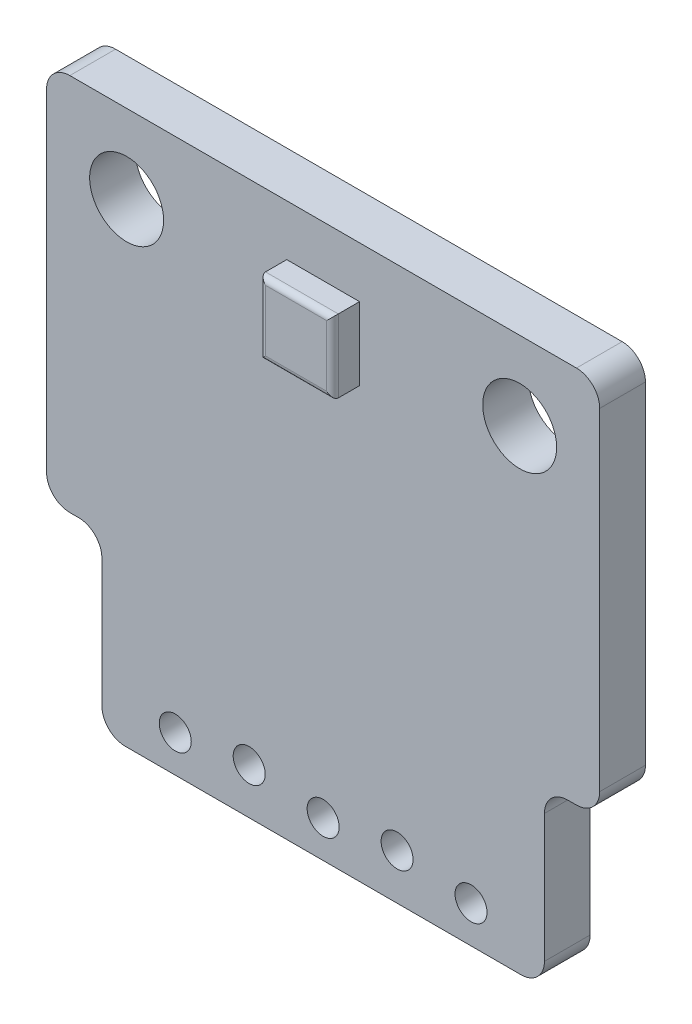
ISO-10303-21;
HEADER;
FILE_DESCRIPTION(('STEP AP214'),'2;1');
FILE_NAME('part.step','',(''),(''),'','','');
FILE_SCHEMA(('AUTOMOTIVE_DESIGN { 1 0 10303 214 1 1 1 1 }'));
ENDSEC;
DATA;
#1=APPLICATION_CONTEXT('core data for automotive mechanical design processes');
#2=APPLICATION_PROTOCOL_DEFINITION('international standard','automotive_design',2000,#1);
#3=PRODUCT_CONTEXT('',#1,'mechanical');
#4=PRODUCT('Part','Part','',(#3));
#5=PRODUCT_RELATED_PRODUCT_CATEGORY('part','',(#4));
#6=PRODUCT_DEFINITION_FORMATION('','',#4);
#7=PRODUCT_DEFINITION_CONTEXT('part definition',#1,'design');
#8=PRODUCT_DEFINITION('design','',#6,#7);
#9=PRODUCT_DEFINITION_SHAPE('','',#8);
#10=(LENGTH_UNIT() NAMED_UNIT(*) SI_UNIT(.MILLI.,.METRE.));
#11=(NAMED_UNIT(*) PLANE_ANGLE_UNIT() SI_UNIT($,.RADIAN.));
#12=(NAMED_UNIT(*) SI_UNIT($,.STERADIAN.) SOLID_ANGLE_UNIT());
#13=UNCERTAINTY_MEASURE_WITH_UNIT(LENGTH_MEASURE(1.E-05),#10,'distance_accuracy_value','');
#14=(GEOMETRIC_REPRESENTATION_CONTEXT(3) GLOBAL_UNCERTAINTY_ASSIGNED_CONTEXT((#13)) GLOBAL_UNIT_ASSIGNED_CONTEXT((#10,
#11,#12)) REPRESENTATION_CONTEXT('',''));
#15=CARTESIAN_POINT('',(0.,0.,0.));
#16=DIRECTION('',(0.,0.,1.));
#17=DIRECTION('',(1.,0.,0.));
#18=AXIS2_PLACEMENT_3D('',#15,#16,#17);
#19=CARTESIAN_POINT('',(0.,0.,1.57));
#20=DIRECTION('',(0.,0.,-1.));
#21=DIRECTION('',(-1.,0.,0.));
#22=AXIS2_PLACEMENT_3D('',#19,#20,#21);
#23=PLANE('',#22);
#24=CARTESIAN_POINT('',(5.08,1.27,1.57));
#25=DIRECTION('',(0.,0.,1.));
#26=DIRECTION('',(1.,0.,0.));
#27=AXIS2_PLACEMENT_3D('',#24,#25,#26);
#28=CIRCLE('',#27,0.55);
#29=CARTESIAN_POINT('',(5.63,1.27,1.57));
#30=VERTEX_POINT('',#29);
#31=EDGE_CURVE('E217',#30,#30,#28,.T.);
#32=ORIENTED_EDGE('',*,*,#31,.F.);
#33=EDGE_LOOP('',(#32));
#34=FACE_BOUND('',#33,.T.);
#35=CARTESIAN_POINT('',(-2.54,1.57,1.57));
#36=DIRECTION('',(0.,0.,1.));
#37=DIRECTION('',(1.,0.,0.));
#38=AXIS2_PLACEMENT_3D('',#35,#36,#37);
#39=CIRCLE('',#38,0.55);
#40=CARTESIAN_POINT('',(-1.99,1.57,1.57));
#41=VERTEX_POINT('',#40);
#42=EDGE_CURVE('E223',#41,#41,#39,.T.);
#43=ORIENTED_EDGE('',*,*,#42,.F.);
#44=EDGE_LOOP('',(#43));
#45=FACE_BOUND('',#44,.T.);
#46=CARTESIAN_POINT('',(-5.08,1.27,1.57));
#47=DIRECTION('',(0.,0.,1.));
#48=DIRECTION('',(1.,0.,0.));
#49=AXIS2_PLACEMENT_3D('',#46,#47,#48);
#50=CIRCLE('',#49,0.55);
#51=CARTESIAN_POINT('',(-4.53,1.27,1.57));
#52=VERTEX_POINT('',#51);
#53=EDGE_CURVE('E229',#52,#52,#50,.T.);
#54=ORIENTED_EDGE('',*,*,#53,.F.);
#55=EDGE_LOOP('',(#54));
#56=FACE_BOUND('',#55,.T.);
#57=CARTESIAN_POINT('',(0.,1.27,1.57));
#58=DIRECTION('',(0.,0.,1.));
#59=DIRECTION('',(1.,0.,0.));
#60=AXIS2_PLACEMENT_3D('',#57,#58,#59);
#61=CIRCLE('',#60,0.55);
#62=CARTESIAN_POINT('',(0.550000000000001,1.27,1.57));
#63=VERTEX_POINT('',#62);
#64=EDGE_CURVE('E235',#63,#63,#61,.T.);
#65=ORIENTED_EDGE('',*,*,#64,.F.);
#66=EDGE_LOOP('',(#65));
#67=FACE_BOUND('',#66,.T.);
#68=CARTESIAN_POINT('',(2.54,1.57,1.57));
#69=DIRECTION('',(0.,0.,1.));
#70=DIRECTION('',(1.,0.,0.));
#71=AXIS2_PLACEMENT_3D('',#68,#69,#70);
#72=CIRCLE('',#71,0.55);
#73=CARTESIAN_POINT('',(3.09,1.57,1.57));
#74=VERTEX_POINT('',#73);
#75=EDGE_CURVE('E241',#74,#74,#72,.T.);
#76=ORIENTED_EDGE('',*,*,#75,.F.);
#77=EDGE_LOOP('',(#76));
#78=FACE_BOUND('',#77,.T.);
#79=CARTESIAN_POINT('',(6.75,16.3,1.57));
#80=DIRECTION('',(0.,0.,1.));
#81=DIRECTION('',(1.,0.,0.));
#82=AXIS2_PLACEMENT_3D('',#79,#80,#81);
#83=CIRCLE('',#82,1.27);
#84=CARTESIAN_POINT('',(8.02,16.3,1.57));
#85=VERTEX_POINT('',#84);
#86=EDGE_CURVE('E247',#85,#85,#83,.T.);
#87=ORIENTED_EDGE('',*,*,#86,.F.);
#88=EDGE_LOOP('',(#87));
#89=FACE_BOUND('',#88,.T.);
#90=CARTESIAN_POINT('',(-6.75,16.3,1.57));
#91=DIRECTION('',(0.,0.,1.));
#92=DIRECTION('',(1.,0.,0.));
#93=AXIS2_PLACEMENT_3D('',#90,#91,#92);
#94=CIRCLE('',#93,1.27);
#95=CARTESIAN_POINT('',(-5.48,16.3,1.57));
#96=VERTEX_POINT('',#95);
#97=EDGE_CURVE('E253',#96,#96,#94,.T.);
#98=ORIENTED_EDGE('',*,*,#97,.F.);
#99=EDGE_LOOP('',(#98));
#100=FACE_BOUND('',#99,.T.);
#101=DIRECTION('',(0.,-1.,0.));
#102=VECTOR('',#101,1.);
#103=CARTESIAN_POINT('',(-7.6,6.,1.57));
#104=LINE('',#103,#102);
#105=CARTESIAN_POINT('',(-7.6,5.2,1.57));
#106=VERTEX_POINT('',#105);
#107=CARTESIAN_POINT('',(-7.6,0.8,1.57));
#108=VERTEX_POINT('',#107);
#109=EDGE_CURVE('E272',#106,#108,#104,.T.);
#110=ORIENTED_EDGE('',*,*,#109,.T.);
#111=CARTESIAN_POINT('',(-6.8,0.8,1.57));
#112=DIRECTION('',(0.,0.,-1.));
#113=DIRECTION('',(-1.,0.,0.));
#114=AXIS2_PLACEMENT_3D('',#111,#112,#113);
#115=CIRCLE('',#114,0.8);
#116=CARTESIAN_POINT('',(-6.8,0.,1.57));
#117=VERTEX_POINT('',#116);
#118=EDGE_CURVE('E338',#108,#117,#115,.F.);
#119=ORIENTED_EDGE('',*,*,#118,.T.);
#120=DIRECTION('',(1.,0.,0.));
#121=VECTOR('',#120,1.);
#122=CARTESIAN_POINT('',(-7.6,0.,1.57));
#123=LINE('',#122,#121);
#124=CARTESIAN_POINT('',(6.8,0.,1.57));
#125=VERTEX_POINT('',#124);
#126=EDGE_CURVE('E275',#117,#125,#123,.T.);
#127=ORIENTED_EDGE('',*,*,#126,.T.);
#128=CARTESIAN_POINT('',(6.8,0.8,1.57));
#129=DIRECTION('',(0.,0.,-1.));
#130=DIRECTION('',(-1.,0.,0.));
#131=AXIS2_PLACEMENT_3D('',#128,#129,#130);
#132=CIRCLE('',#131,0.8);
#133=CARTESIAN_POINT('',(7.6,0.8,1.57));
#134=VERTEX_POINT('',#133);
#135=EDGE_CURVE('E328',#125,#134,#132,.F.);
#136=ORIENTED_EDGE('',*,*,#135,.T.);
#137=DIRECTION('',(0.,1.,0.));
#138=VECTOR('',#137,1.);
#139=CARTESIAN_POINT('',(7.6,0.,1.57));
#140=LINE('',#139,#138);
#141=CARTESIAN_POINT('',(7.6,5.2,1.57));
#142=VERTEX_POINT('',#141);
#143=EDGE_CURVE('E278',#134,#142,#140,.T.);
#144=ORIENTED_EDGE('',*,*,#143,.T.);
#145=CARTESIAN_POINT('',(8.4,5.2,1.57));
#146=DIRECTION('',(0.,0.,-1.));
#147=DIRECTION('',(-1.,0.,0.));
#148=AXIS2_PLACEMENT_3D('',#145,#146,#147);
#149=CIRCLE('',#148,0.8);
#150=CARTESIAN_POINT('',(8.4,6.,1.57));
#151=VERTEX_POINT('',#150);
#152=EDGE_CURVE('E376',#142,#151,#149,.T.);
#153=ORIENTED_EDGE('',*,*,#152,.T.);
#154=DIRECTION('',(1.,0.,0.));
#155=VECTOR('',#154,1.);
#156=CARTESIAN_POINT('',(7.6,6.,1.57));
#157=LINE('',#156,#155);
#158=CARTESIAN_POINT('',(8.7,6.,1.57));
#159=VERTEX_POINT('',#158);
#160=EDGE_CURVE('E281',#151,#159,#157,.T.);
#161=ORIENTED_EDGE('',*,*,#160,.T.);
#162=CARTESIAN_POINT('',(8.7,6.8,1.57));
#163=DIRECTION('',(0.,0.,-1.));
#164=DIRECTION('',(-1.,0.,0.));
#165=AXIS2_PLACEMENT_3D('',#162,#163,#164);
#166=CIRCLE('',#165,0.8);
#167=CARTESIAN_POINT('',(9.5,6.8,1.57));
#168=VERTEX_POINT('',#167);
#169=EDGE_CURVE('E330',#159,#168,#166,.F.);
#170=ORIENTED_EDGE('',*,*,#169,.T.);
#171=DIRECTION('',(0.,1.,0.));
#172=VECTOR('',#171,1.);
#173=CARTESIAN_POINT('',(9.5,6.,1.57));
#174=LINE('',#173,#172);
#175=CARTESIAN_POINT('',(9.49999999999999,18.2,1.57));
#176=VERTEX_POINT('',#175);
#177=EDGE_CURVE('E259',#168,#176,#174,.T.);
#178=ORIENTED_EDGE('',*,*,#177,.T.);
#179=CARTESIAN_POINT('',(8.69999999999999,18.2,1.57));
#180=DIRECTION('',(0.,0.,-1.));
#181=DIRECTION('',(-1.,0.,0.));
#182=AXIS2_PLACEMENT_3D('',#179,#180,#181);
#183=CIRCLE('',#182,0.8);
#184=CARTESIAN_POINT('',(8.69999999999999,19.,1.57));
#185=VERTEX_POINT('',#184);
#186=EDGE_CURVE('E332',#176,#185,#183,.F.);
#187=ORIENTED_EDGE('',*,*,#186,.T.);
#188=DIRECTION('',(-1.,0.,0.));
#189=VECTOR('',#188,1.);
#190=CARTESIAN_POINT('',(-9.5,19.,1.57));
#191=LINE('',#190,#189);
#192=CARTESIAN_POINT('',(-8.7,19.,1.57));
#193=VERTEX_POINT('',#192);
#194=EDGE_CURVE('E262',#185,#193,#191,.T.);
#195=ORIENTED_EDGE('',*,*,#194,.T.);
#196=CARTESIAN_POINT('',(-8.7,18.2,1.57));
#197=DIRECTION('',(0.,0.,-1.));
#198=DIRECTION('',(-1.,0.,0.));
#199=AXIS2_PLACEMENT_3D('',#196,#197,#198);
#200=CIRCLE('',#199,0.8);
#201=CARTESIAN_POINT('',(-9.5,18.2,1.57));
#202=VERTEX_POINT('',#201);
#203=EDGE_CURVE('E334',#193,#202,#200,.F.);
#204=ORIENTED_EDGE('',*,*,#203,.T.);
#205=DIRECTION('',(0.,-1.,0.));
#206=VECTOR('',#205,1.);
#207=CARTESIAN_POINT('',(-9.5,19.,1.57));
#208=LINE('',#207,#206);
#209=CARTESIAN_POINT('',(-9.5,6.8,1.57));
#210=VERTEX_POINT('',#209);
#211=EDGE_CURVE('E266',#202,#210,#208,.T.);
#212=ORIENTED_EDGE('',*,*,#211,.T.);
#213=CARTESIAN_POINT('',(-8.7,6.8,1.57));
#214=DIRECTION('',(0.,0.,-1.));
#215=DIRECTION('',(-1.,0.,0.));
#216=AXIS2_PLACEMENT_3D('',#213,#214,#215);
#217=CIRCLE('',#216,0.8);
#218=CARTESIAN_POINT('',(-8.7,6.,1.57));
#219=VERTEX_POINT('',#218);
#220=EDGE_CURVE('E336',#210,#219,#217,.F.);
#221=ORIENTED_EDGE('',*,*,#220,.T.);
#222=DIRECTION('',(1.,0.,0.));
#223=VECTOR('',#222,1.);
#224=CARTESIAN_POINT('',(-9.5,6.,1.57));
#225=LINE('',#224,#223);
#226=CARTESIAN_POINT('',(-8.4,6.,1.57));
#227=VERTEX_POINT('',#226);
#228=EDGE_CURVE('E269',#219,#227,#225,.T.);
#229=ORIENTED_EDGE('',*,*,#228,.T.);
#230=CARTESIAN_POINT('',(-8.4,5.2,1.57));
#231=DIRECTION('',(0.,0.,-1.));
#232=DIRECTION('',(-1.,0.,0.));
#233=AXIS2_PLACEMENT_3D('',#230,#231,#232);
#234=CIRCLE('',#233,0.8);
#235=EDGE_CURVE('E372',#227,#106,#234,.T.);
#236=ORIENTED_EDGE('',*,*,#235,.T.);
#237=EDGE_LOOP('',(#110,#119,#127,#136,#144,#153,#161,#170,#178,#187,#195,#204,#212,#221,#229,#236));
#238=FACE_BOUND('',#237,.T.);
#239=DIRECTION('',(0.,1.,0.));
#240=VECTOR('',#239,1.);
#241=CARTESIAN_POINT('',(1.25,14.75,1.57));
#242=LINE('',#241,#240);
#243=CARTESIAN_POINT('',(1.25,14.75,1.57));
#244=VERTEX_POINT('',#243);
#245=CARTESIAN_POINT('',(1.25,17.25,1.57));
#246=VERTEX_POINT('',#245);
#247=EDGE_CURVE('E188',#244,#246,#242,.T.);
#248=ORIENTED_EDGE('',*,*,#247,.F.);
#249=DIRECTION('',(1.,0.,0.));
#250=VECTOR('',#249,1.);
#251=CARTESIAN_POINT('',(-1.25,14.75,1.57));
#252=LINE('',#251,#250);
#253=CARTESIAN_POINT('',(-1.25,14.75,1.57));
#254=VERTEX_POINT('',#253);
#255=EDGE_CURVE('E195',#254,#244,#252,.T.);
#256=ORIENTED_EDGE('',*,*,#255,.F.);
#257=DIRECTION('',(0.,-1.,0.));
#258=VECTOR('',#257,1.);
#259=CARTESIAN_POINT('',(-1.25,14.75,1.57));
#260=LINE('',#259,#258);
#261=CARTESIAN_POINT('',(-1.25,17.25,1.57));
#262=VERTEX_POINT('',#261);
#263=EDGE_CURVE('E206',#262,#254,#260,.T.);
#264=ORIENTED_EDGE('',*,*,#263,.F.);
#265=DIRECTION('',(-1.,0.,0.));
#266=VECTOR('',#265,1.);
#267=CARTESIAN_POINT('',(-1.25,17.25,1.57));
#268=LINE('',#267,#266);
#269=EDGE_CURVE('E203',#246,#262,#268,.T.);
#270=ORIENTED_EDGE('',*,*,#269,.F.);
#271=EDGE_LOOP('',(#248,#256,#264,#270));
#272=FACE_BOUND('',#271,.T.);
#273=ADVANCED_FACE('F35',(#34,#45,#56,#67,#78,#89,#100,#238,#272),#23,.F.);
#274=CARTESIAN_POINT('',(0.,0.,0.));
#275=DIRECTION('',(0.,0.,-1.));
#276=DIRECTION('',(-1.,0.,0.));
#277=AXIS2_PLACEMENT_3D('',#274,#275,#276);
#278=PLANE('',#277);
#279=CARTESIAN_POINT('',(-2.54,1.57,0.));
#280=DIRECTION('',(0.,0.,1.));
#281=DIRECTION('',(1.,0.,0.));
#282=AXIS2_PLACEMENT_3D('',#279,#280,#281);
#283=CIRCLE('',#282,0.55);
#284=CARTESIAN_POINT('',(-1.99,1.57,0.));
#285=VERTEX_POINT('',#284);
#286=EDGE_CURVE('E220',#285,#285,#283,.T.);
#287=ORIENTED_EDGE('',*,*,#286,.T.);
#288=EDGE_LOOP('',(#287));
#289=FACE_BOUND('',#288,.T.);
#290=CARTESIAN_POINT('',(0.,1.27,0.));
#291=DIRECTION('',(0.,0.,1.));
#292=DIRECTION('',(1.,0.,0.));
#293=AXIS2_PLACEMENT_3D('',#290,#291,#292);
#294=CIRCLE('',#293,0.55);
#295=CARTESIAN_POINT('',(0.550000000000001,1.27,0.));
#296=VERTEX_POINT('',#295);
#297=EDGE_CURVE('E232',#296,#296,#294,.T.);
#298=ORIENTED_EDGE('',*,*,#297,.T.);
#299=EDGE_LOOP('',(#298));
#300=FACE_BOUND('',#299,.T.);
#301=CARTESIAN_POINT('',(6.75,16.3,0.));
#302=DIRECTION('',(0.,0.,1.));
#303=DIRECTION('',(1.,0.,0.));
#304=AXIS2_PLACEMENT_3D('',#301,#302,#303);
#305=CIRCLE('',#304,1.27);
#306=CARTESIAN_POINT('',(8.02,16.3,0.));
#307=VERTEX_POINT('',#306);
#308=EDGE_CURVE('E244',#307,#307,#305,.T.);
#309=ORIENTED_EDGE('',*,*,#308,.T.);
#310=EDGE_LOOP('',(#309));
#311=FACE_BOUND('',#310,.T.);
#312=DIRECTION('',(1.,0.,0.));
#313=VECTOR('',#312,1.);
#314=CARTESIAN_POINT('',(-7.6,0.,0.));
#315=LINE('',#314,#313);
#316=CARTESIAN_POINT('',(-6.8,0.,0.));
#317=VERTEX_POINT('',#316);
#318=CARTESIAN_POINT('',(6.8,0.,0.));
#319=VERTEX_POINT('',#318);
#320=EDGE_CURVE('E299',#317,#319,#315,.T.);
#321=ORIENTED_EDGE('',*,*,#320,.F.);
#322=CARTESIAN_POINT('',(-6.8,0.8,0.));
#323=DIRECTION('',(0.,0.,-1.));
#324=DIRECTION('',(-1.,0.,0.));
#325=AXIS2_PLACEMENT_3D('',#322,#323,#324);
#326=CIRCLE('',#325,0.8);
#327=CARTESIAN_POINT('',(-7.6,0.8,0.));
#328=VERTEX_POINT('',#327);
#329=EDGE_CURVE('E321',#317,#328,#326,.T.);
#330=ORIENTED_EDGE('',*,*,#329,.T.);
#331=DIRECTION('',(0.,-1.,0.));
#332=VECTOR('',#331,1.);
#333=CARTESIAN_POINT('',(-7.6,6.,0.));
#334=LINE('',#333,#332);
#335=CARTESIAN_POINT('',(-7.6,5.2,0.));
#336=VERTEX_POINT('',#335);
#337=EDGE_CURVE('E296',#336,#328,#334,.T.);
#338=ORIENTED_EDGE('',*,*,#337,.F.);
#339=CARTESIAN_POINT('',(-8.4,5.2,0.));
#340=DIRECTION('',(0.,0.,-1.));
#341=DIRECTION('',(-1.,0.,0.));
#342=AXIS2_PLACEMENT_3D('',#339,#340,#341);
#343=CIRCLE('',#342,0.8);
#344=CARTESIAN_POINT('',(-8.4,6.,0.));
#345=VERTEX_POINT('',#344);
#346=EDGE_CURVE('E370',#336,#345,#343,.F.);
#347=ORIENTED_EDGE('',*,*,#346,.T.);
#348=DIRECTION('',(1.,0.,0.));
#349=VECTOR('',#348,1.);
#350=CARTESIAN_POINT('',(-9.5,6.,0.));
#351=LINE('',#350,#349);
#352=CARTESIAN_POINT('',(-8.7,6.,0.));
#353=VERTEX_POINT('',#352);
#354=EDGE_CURVE('E293',#353,#345,#351,.T.);
#355=ORIENTED_EDGE('',*,*,#354,.F.);
#356=CARTESIAN_POINT('',(-8.7,6.8,0.));
#357=DIRECTION('',(0.,0.,-1.));
#358=DIRECTION('',(-1.,0.,0.));
#359=AXIS2_PLACEMENT_3D('',#356,#357,#358);
#360=CIRCLE('',#359,0.8);
#361=CARTESIAN_POINT('',(-9.5,6.8,0.));
#362=VERTEX_POINT('',#361);
#363=EDGE_CURVE('E319',#353,#362,#360,.T.);
#364=ORIENTED_EDGE('',*,*,#363,.T.);
#365=DIRECTION('',(0.,-1.,0.));
#366=VECTOR('',#365,1.);
#367=CARTESIAN_POINT('',(-9.5,19.,0.));
#368=LINE('',#367,#366);
#369=CARTESIAN_POINT('',(-9.5,18.2,0.));
#370=VERTEX_POINT('',#369);
#371=EDGE_CURVE('E290',#370,#362,#368,.T.);
#372=ORIENTED_EDGE('',*,*,#371,.F.);
#373=CARTESIAN_POINT('',(-8.7,18.2,0.));
#374=DIRECTION('',(0.,0.,-1.));
#375=DIRECTION('',(-1.,0.,0.));
#376=AXIS2_PLACEMENT_3D('',#373,#374,#375);
#377=CIRCLE('',#376,0.8);
#378=CARTESIAN_POINT('',(-8.7,19.,0.));
#379=VERTEX_POINT('',#378);
#380=EDGE_CURVE('E317',#370,#379,#377,.T.);
#381=ORIENTED_EDGE('',*,*,#380,.T.);
#382=DIRECTION('',(-1.,0.,0.));
#383=VECTOR('',#382,1.);
#384=CARTESIAN_POINT('',(-9.5,19.,0.));
#385=LINE('',#384,#383);
#386=CARTESIAN_POINT('',(8.69999999999999,19.,0.));
#387=VERTEX_POINT('',#386);
#388=EDGE_CURVE('E287',#387,#379,#385,.T.);
#389=ORIENTED_EDGE('',*,*,#388,.F.);
#390=CARTESIAN_POINT('',(8.69999999999999,18.2,0.));
#391=DIRECTION('',(0.,0.,-1.));
#392=DIRECTION('',(-1.,0.,0.));
#393=AXIS2_PLACEMENT_3D('',#390,#391,#392);
#394=CIRCLE('',#393,0.8);
#395=CARTESIAN_POINT('',(9.49999999999999,18.2,0.));
#396=VERTEX_POINT('',#395);
#397=EDGE_CURVE('E315',#387,#396,#394,.T.);
#398=ORIENTED_EDGE('',*,*,#397,.T.);
#399=DIRECTION('',(0.,1.,0.));
#400=VECTOR('',#399,1.);
#401=CARTESIAN_POINT('',(9.5,6.,0.));
#402=LINE('',#401,#400);
#403=CARTESIAN_POINT('',(9.5,6.8,0.));
#404=VERTEX_POINT('',#403);
#405=EDGE_CURVE('E256',#404,#396,#402,.T.);
#406=ORIENTED_EDGE('',*,*,#405,.F.);
#407=CARTESIAN_POINT('',(8.7,6.8,0.));
#408=DIRECTION('',(0.,0.,-1.));
#409=DIRECTION('',(-1.,0.,0.));
#410=AXIS2_PLACEMENT_3D('',#407,#408,#409);
#411=CIRCLE('',#410,0.8);
#412=CARTESIAN_POINT('',(8.7,6.,0.));
#413=VERTEX_POINT('',#412);
#414=EDGE_CURVE('E313',#404,#413,#411,.T.);
#415=ORIENTED_EDGE('',*,*,#414,.T.);
#416=DIRECTION('',(1.,0.,0.));
#417=VECTOR('',#416,1.);
#418=CARTESIAN_POINT('',(7.6,6.,0.));
#419=LINE('',#418,#417);
#420=CARTESIAN_POINT('',(8.4,6.,0.));
#421=VERTEX_POINT('',#420);
#422=EDGE_CURVE('E263',#421,#413,#419,.T.);
#423=ORIENTED_EDGE('',*,*,#422,.F.);
#424=CARTESIAN_POINT('',(8.4,5.2,0.));
#425=DIRECTION('',(0.,0.,-1.));
#426=DIRECTION('',(-1.,0.,0.));
#427=AXIS2_PLACEMENT_3D('',#424,#425,#426);
#428=CIRCLE('',#427,0.8);
#429=CARTESIAN_POINT('',(7.6,5.2,0.));
#430=VERTEX_POINT('',#429);
#431=EDGE_CURVE('E374',#421,#430,#428,.F.);
#432=ORIENTED_EDGE('',*,*,#431,.T.);
#433=DIRECTION('',(0.,1.,0.));
#434=VECTOR('',#433,1.);
#435=CARTESIAN_POINT('',(7.6,0.,0.));
#436=LINE('',#435,#434);
#437=CARTESIAN_POINT('',(7.6,0.8,0.));
#438=VERTEX_POINT('',#437);
#439=EDGE_CURVE('E302',#438,#430,#436,.T.);
#440=ORIENTED_EDGE('',*,*,#439,.F.);
#441=CARTESIAN_POINT('',(6.8,0.8,0.));
#442=DIRECTION('',(0.,0.,-1.));
#443=DIRECTION('',(-1.,0.,0.));
#444=AXIS2_PLACEMENT_3D('',#441,#442,#443);
#445=CIRCLE('',#444,0.8);
#446=EDGE_CURVE('E311',#438,#319,#445,.T.);
#447=ORIENTED_EDGE('',*,*,#446,.T.);
#448=EDGE_LOOP('',(#321,#330,#338,#347,#355,#364,#372,#381,#389,#398,#406,#415,#423,#432,#440,#447));
#449=FACE_BOUND('',#448,.T.);
#450=CARTESIAN_POINT('',(-6.75,16.3,0.));
#451=DIRECTION('',(0.,0.,1.));
#452=DIRECTION('',(1.,0.,0.));
#453=AXIS2_PLACEMENT_3D('',#450,#451,#452);
#454=CIRCLE('',#453,1.27);
#455=CARTESIAN_POINT('',(-5.48,16.3,0.));
#456=VERTEX_POINT('',#455);
#457=EDGE_CURVE('E250',#456,#456,#454,.T.);
#458=ORIENTED_EDGE('',*,*,#457,.T.);
#459=EDGE_LOOP('',(#458));
#460=FACE_BOUND('',#459,.T.);
#461=CARTESIAN_POINT('',(2.54,1.57,0.));
#462=DIRECTION('',(0.,0.,1.));
#463=DIRECTION('',(1.,0.,0.));
#464=AXIS2_PLACEMENT_3D('',#461,#462,#463);
#465=CIRCLE('',#464,0.55);
#466=CARTESIAN_POINT('',(3.09,1.57,0.));
#467=VERTEX_POINT('',#466);
#468=EDGE_CURVE('E238',#467,#467,#465,.T.);
#469=ORIENTED_EDGE('',*,*,#468,.T.);
#470=EDGE_LOOP('',(#469));
#471=FACE_BOUND('',#470,.T.);
#472=CARTESIAN_POINT('',(-5.08,1.27,0.));
#473=DIRECTION('',(0.,0.,1.));
#474=DIRECTION('',(1.,0.,0.));
#475=AXIS2_PLACEMENT_3D('',#472,#473,#474);
#476=CIRCLE('',#475,0.55);
#477=CARTESIAN_POINT('',(-4.53,1.27,0.));
#478=VERTEX_POINT('',#477);
#479=EDGE_CURVE('E226',#478,#478,#476,.T.);
#480=ORIENTED_EDGE('',*,*,#479,.T.);
#481=EDGE_LOOP('',(#480));
#482=FACE_BOUND('',#481,.T.);
#483=CARTESIAN_POINT('',(5.08,1.27,0.));
#484=DIRECTION('',(0.,0.,1.));
#485=DIRECTION('',(1.,0.,0.));
#486=AXIS2_PLACEMENT_3D('',#483,#484,#485);
#487=CIRCLE('',#486,0.55);
#488=CARTESIAN_POINT('',(5.63,1.27,0.));
#489=VERTEX_POINT('',#488);
#490=EDGE_CURVE('E216',#489,#489,#487,.T.);
#491=ORIENTED_EDGE('',*,*,#490,.T.);
#492=EDGE_LOOP('',(#491));
#493=FACE_BOUND('',#492,.T.);
#494=ADVANCED_FACE('F424',(#289,#300,#311,#449,#460,#471,#482,#493),#278,.T.);
#495=CARTESIAN_POINT('',(9.5,6.,1.57));
#496=DIRECTION('',(-1.,0.,0.));
#497=DIRECTION('',(0.,-1.,0.));
#498=AXIS2_PLACEMENT_3D('',#495,#496,#497);
#499=PLANE('',#498);
#500=ORIENTED_EDGE('',*,*,#405,.T.);
#501=DIRECTION('',(0.,0.,-1.));
#502=VECTOR('',#501,1.);
#503=CARTESIAN_POINT('',(9.49999999999999,18.2,1.57));
#504=LINE('',#503,#502);
#505=EDGE_CURVE('E358',#396,#176,#504,.F.);
#506=ORIENTED_EDGE('',*,*,#505,.T.);
#507=ORIENTED_EDGE('',*,*,#177,.F.);
#508=DIRECTION('',(0.,0.,-1.));
#509=VECTOR('',#508,1.);
#510=CARTESIAN_POINT('',(9.5,6.8,1.57));
#511=LINE('',#510,#509);
#512=EDGE_CURVE('E355',#168,#404,#511,.T.);
#513=ORIENTED_EDGE('',*,*,#512,.T.);
#514=EDGE_LOOP('',(#500,#506,#507,#513));
#515=FACE_BOUND('',#514,.T.);
#516=ADVANCED_FACE('F430',(#515),#499,.F.);
#517=CARTESIAN_POINT('',(-9.5,19.,1.57));
#518=DIRECTION('',(0.,-1.,0.));
#519=DIRECTION('',(1.,0.,0.));
#520=AXIS2_PLACEMENT_3D('',#517,#518,#519);
#521=PLANE('',#520);
#522=ORIENTED_EDGE('',*,*,#388,.T.);
#523=DIRECTION('',(0.,0.,-1.));
#524=VECTOR('',#523,1.);
#525=CARTESIAN_POINT('',(-8.7,19.,1.57));
#526=LINE('',#525,#524);
#527=EDGE_CURVE('E353',#379,#193,#526,.F.);
#528=ORIENTED_EDGE('',*,*,#527,.T.);
#529=ORIENTED_EDGE('',*,*,#194,.F.);
#530=DIRECTION('',(0.,0.,-1.));
#531=VECTOR('',#530,1.);
#532=CARTESIAN_POINT('',(8.69999999999999,19.,1.57));
#533=LINE('',#532,#531);
#534=EDGE_CURVE('E350',#185,#387,#533,.T.);
#535=ORIENTED_EDGE('',*,*,#534,.T.);
#536=EDGE_LOOP('',(#522,#528,#529,#535));
#537=FACE_BOUND('',#536,.T.);
#538=ADVANCED_FACE('F462',(#537),#521,.F.);
#539=CARTESIAN_POINT('',(-9.5,19.,1.57));
#540=DIRECTION('',(1.,0.,0.));
#541=DIRECTION('',(0.,0.,-1.));
#542=AXIS2_PLACEMENT_3D('',#539,#540,#541);
#543=PLANE('',#542);
#544=ORIENTED_EDGE('',*,*,#371,.T.);
#545=DIRECTION('',(0.,0.,-1.));
#546=VECTOR('',#545,1.);
#547=CARTESIAN_POINT('',(-9.5,6.8,1.57));
#548=LINE('',#547,#546);
#549=EDGE_CURVE('E348',#362,#210,#548,.F.);
#550=ORIENTED_EDGE('',*,*,#549,.T.);
#551=ORIENTED_EDGE('',*,*,#211,.F.);
#552=DIRECTION('',(0.,0.,-1.));
#553=VECTOR('',#552,1.);
#554=CARTESIAN_POINT('',(-9.5,18.2,1.57));
#555=LINE('',#554,#553);
#556=EDGE_CURVE('E345',#202,#370,#555,.T.);
#557=ORIENTED_EDGE('',*,*,#556,.T.);
#558=EDGE_LOOP('',(#544,#550,#551,#557));
#559=FACE_BOUND('',#558,.T.);
#560=ADVANCED_FACE('F458',(#559),#543,.F.);
#561=CARTESIAN_POINT('',(-9.5,6.,1.57));
#562=DIRECTION('',(0.,1.,0.));
#563=DIRECTION('',(-1.,0.,0.));
#564=AXIS2_PLACEMENT_3D('',#561,#562,#563);
#565=PLANE('',#564);
#566=ORIENTED_EDGE('',*,*,#354,.T.);
#567=DIRECTION('',(0.,0.,-1.));
#568=VECTOR('',#567,1.);
#569=CARTESIAN_POINT('',(-8.4,6.,1.57));
#570=LINE('',#569,#568);
#571=EDGE_CURVE('E343',#345,#227,#570,.F.);
#572=ORIENTED_EDGE('',*,*,#571,.T.);
#573=ORIENTED_EDGE('',*,*,#228,.F.);
#574=DIRECTION('',(0.,0.,-1.));
#575=VECTOR('',#574,1.);
#576=CARTESIAN_POINT('',(-8.7,6.,1.57));
#577=LINE('',#576,#575);
#578=EDGE_CURVE('E340',#219,#353,#577,.T.);
#579=ORIENTED_EDGE('',*,*,#578,.T.);
#580=EDGE_LOOP('',(#566,#572,#573,#579));
#581=FACE_BOUND('',#580,.T.);
#582=ADVANCED_FACE('F454',(#581),#565,.F.);
#583=CARTESIAN_POINT('',(-7.6,6.,1.57));
#584=DIRECTION('',(1.,0.,0.));
#585=DIRECTION('',(0.,0.,-1.));
#586=AXIS2_PLACEMENT_3D('',#583,#584,#585);
#587=PLANE('',#586);
#588=ORIENTED_EDGE('',*,*,#337,.T.);
#589=DIRECTION('',(0.,0.,-1.));
#590=VECTOR('',#589,1.);
#591=CARTESIAN_POINT('',(-7.6,0.8,1.57));
#592=LINE('',#591,#590);
#593=EDGE_CURVE('E326',#328,#108,#592,.F.);
#594=ORIENTED_EDGE('',*,*,#593,.T.);
#595=ORIENTED_EDGE('',*,*,#109,.F.);
#596=DIRECTION('',(0.,0.,-1.));
#597=VECTOR('',#596,1.);
#598=CARTESIAN_POINT('',(-7.6,5.2,0.));
#599=LINE('',#598,#597);
#600=EDGE_CURVE('E323',#106,#336,#599,.T.);
#601=ORIENTED_EDGE('',*,*,#600,.T.);
#602=EDGE_LOOP('',(#588,#594,#595,#601));
#603=FACE_BOUND('',#602,.T.);
#604=ADVANCED_FACE('F450',(#603),#587,.F.);
#605=CARTESIAN_POINT('',(-7.6,0.,1.57));
#606=DIRECTION('',(0.,1.,0.));
#607=DIRECTION('',(-1.,0.,0.));
#608=AXIS2_PLACEMENT_3D('',#605,#606,#607);
#609=PLANE('',#608);
#610=ORIENTED_EDGE('',*,*,#126,.F.);
#611=DIRECTION('',(0.,0.,-1.));
#612=VECTOR('',#611,1.);
#613=CARTESIAN_POINT('',(-6.8,0.,1.57));
#614=LINE('',#613,#612);
#615=EDGE_CURVE('E308',#117,#317,#614,.T.);
#616=ORIENTED_EDGE('',*,*,#615,.T.);
#617=ORIENTED_EDGE('',*,*,#320,.T.);
#618=DIRECTION('',(0.,0.,-1.));
#619=VECTOR('',#618,1.);
#620=CARTESIAN_POINT('',(6.8,0.,1.57));
#621=LINE('',#620,#619);
#622=EDGE_CURVE('E284',#319,#125,#621,.F.);
#623=ORIENTED_EDGE('',*,*,#622,.T.);
#624=EDGE_LOOP('',(#610,#616,#617,#623));
#625=FACE_BOUND('',#624,.T.);
#626=ADVANCED_FACE('F446',(#625),#609,.F.);
#627=CARTESIAN_POINT('',(7.6,0.,1.57));
#628=DIRECTION('',(-1.,0.,0.));
#629=DIRECTION('',(0.,-1.,0.));
#630=AXIS2_PLACEMENT_3D('',#627,#628,#629);
#631=PLANE('',#630);
#632=ORIENTED_EDGE('',*,*,#439,.T.);
#633=DIRECTION('',(0.,0.,-1.));
#634=VECTOR('',#633,1.);
#635=CARTESIAN_POINT('',(7.6,5.2,1.57));
#636=LINE('',#635,#634);
#637=EDGE_CURVE('E368',#430,#142,#636,.F.);
#638=ORIENTED_EDGE('',*,*,#637,.T.);
#639=ORIENTED_EDGE('',*,*,#143,.F.);
#640=DIRECTION('',(0.,0.,-1.));
#641=VECTOR('',#640,1.);
#642=CARTESIAN_POINT('',(7.6,0.8,1.57));
#643=LINE('',#642,#641);
#644=EDGE_CURVE('E365',#134,#438,#643,.T.);
#645=ORIENTED_EDGE('',*,*,#644,.T.);
#646=EDGE_LOOP('',(#632,#638,#639,#645));
#647=FACE_BOUND('',#646,.T.);
#648=ADVANCED_FACE('F442',(#647),#631,.F.);
#649=CARTESIAN_POINT('',(7.6,6.,1.57));
#650=DIRECTION('',(0.,1.,0.));
#651=DIRECTION('',(-1.,0.,0.));
#652=AXIS2_PLACEMENT_3D('',#649,#650,#651);
#653=PLANE('',#652);
#654=ORIENTED_EDGE('',*,*,#422,.T.);
#655=DIRECTION('',(0.,0.,-1.));
#656=VECTOR('',#655,1.);
#657=CARTESIAN_POINT('',(8.7,6.,1.57));
#658=LINE('',#657,#656);
#659=EDGE_CURVE('E363',#413,#159,#658,.F.);
#660=ORIENTED_EDGE('',*,*,#659,.T.);
#661=ORIENTED_EDGE('',*,*,#160,.F.);
#662=DIRECTION('',(0.,0.,-1.));
#663=VECTOR('',#662,1.);
#664=CARTESIAN_POINT('',(8.4,6.,0.));
#665=LINE('',#664,#663);
#666=EDGE_CURVE('E360',#151,#421,#665,.T.);
#667=ORIENTED_EDGE('',*,*,#666,.T.);
#668=EDGE_LOOP('',(#654,#660,#661,#667));
#669=FACE_BOUND('',#668,.T.);
#670=ADVANCED_FACE('F439',(#669),#653,.F.);
#671=CARTESIAN_POINT('',(-6.75,16.3,1.57));
#672=DIRECTION('',(0.,0.,-1.));
#673=DIRECTION('',(-1.,0.,0.));
#674=AXIS2_PLACEMENT_3D('',#671,#672,#673);
#675=CYLINDRICAL_SURFACE('',#674,1.27);
#676=ORIENTED_EDGE('',*,*,#97,.T.);
#677=EDGE_LOOP('',(#676));
#678=FACE_BOUND('',#677,.T.);
#679=ORIENTED_EDGE('',*,*,#457,.F.);
#680=EDGE_LOOP('',(#679));
#681=FACE_BOUND('',#680,.T.);
#682=ADVANCED_FACE('F436',(#678,#681),#675,.F.);
#683=CARTESIAN_POINT('',(6.75,16.3,1.57));
#684=DIRECTION('',(0.,0.,-1.));
#685=DIRECTION('',(-1.,0.,0.));
#686=AXIS2_PLACEMENT_3D('',#683,#684,#685);
#687=CYLINDRICAL_SURFACE('',#686,1.27);
#688=ORIENTED_EDGE('',*,*,#86,.T.);
#689=EDGE_LOOP('',(#688));
#690=FACE_BOUND('',#689,.T.);
#691=ORIENTED_EDGE('',*,*,#308,.F.);
#692=EDGE_LOOP('',(#691));
#693=FACE_BOUND('',#692,.T.);
#694=ADVANCED_FACE('F694',(#690,#693),#687,.F.);
#695=CARTESIAN_POINT('',(2.54,1.57,1.57));
#696=DIRECTION('',(0.,0.,-1.));
#697=DIRECTION('',(-1.,0.,0.));
#698=AXIS2_PLACEMENT_3D('',#695,#696,#697);
#699=CYLINDRICAL_SURFACE('',#698,0.55);
#700=ORIENTED_EDGE('',*,*,#75,.T.);
#701=EDGE_LOOP('',(#700));
#702=FACE_BOUND('',#701,.T.);
#703=ORIENTED_EDGE('',*,*,#468,.F.);
#704=EDGE_LOOP('',(#703));
#705=FACE_BOUND('',#704,.T.);
#706=ADVANCED_FACE('F684',(#702,#705),#699,.F.);
#707=CARTESIAN_POINT('',(0.,1.27,1.57));
#708=DIRECTION('',(0.,0.,-1.));
#709=DIRECTION('',(-1.,0.,0.));
#710=AXIS2_PLACEMENT_3D('',#707,#708,#709);
#711=CYLINDRICAL_SURFACE('',#710,0.55);
#712=ORIENTED_EDGE('',*,*,#64,.T.);
#713=EDGE_LOOP('',(#712));
#714=FACE_BOUND('',#713,.T.);
#715=ORIENTED_EDGE('',*,*,#297,.F.);
#716=EDGE_LOOP('',(#715));
#717=FACE_BOUND('',#716,.T.);
#718=ADVANCED_FACE('F674',(#714,#717),#711,.F.);
#719=CARTESIAN_POINT('',(-5.08,1.27,1.57));
#720=DIRECTION('',(0.,0.,-1.));
#721=DIRECTION('',(-1.,0.,0.));
#722=AXIS2_PLACEMENT_3D('',#719,#720,#721);
#723=CYLINDRICAL_SURFACE('',#722,0.55);
#724=ORIENTED_EDGE('',*,*,#53,.T.);
#725=EDGE_LOOP('',(#724));
#726=FACE_BOUND('',#725,.T.);
#727=ORIENTED_EDGE('',*,*,#479,.F.);
#728=EDGE_LOOP('',(#727));
#729=FACE_BOUND('',#728,.T.);
#730=ADVANCED_FACE('F664',(#726,#729),#723,.F.);
#731=CARTESIAN_POINT('',(-2.54,1.57,1.57));
#732=DIRECTION('',(0.,0.,-1.));
#733=DIRECTION('',(-1.,0.,0.));
#734=AXIS2_PLACEMENT_3D('',#731,#732,#733);
#735=CYLINDRICAL_SURFACE('',#734,0.55);
#736=ORIENTED_EDGE('',*,*,#42,.T.);
#737=EDGE_LOOP('',(#736));
#738=FACE_BOUND('',#737,.T.);
#739=ORIENTED_EDGE('',*,*,#286,.F.);
#740=EDGE_LOOP('',(#739));
#741=FACE_BOUND('',#740,.T.);
#742=ADVANCED_FACE('F654',(#738,#741),#735,.F.);
#743=CARTESIAN_POINT('',(5.08,1.27,1.57));
#744=DIRECTION('',(0.,0.,-1.));
#745=DIRECTION('',(-1.,0.,0.));
#746=AXIS2_PLACEMENT_3D('',#743,#744,#745);
#747=CYLINDRICAL_SURFACE('',#746,0.55);
#748=ORIENTED_EDGE('',*,*,#31,.T.);
#749=EDGE_LOOP('',(#748));
#750=FACE_BOUND('',#749,.T.);
#751=ORIENTED_EDGE('',*,*,#490,.F.);
#752=EDGE_LOOP('',(#751));
#753=FACE_BOUND('',#752,.T.);
#754=ADVANCED_FACE('F474',(#750,#753),#747,.F.);
#755=CARTESIAN_POINT('',(-6.8,0.8,1.57));
#756=DIRECTION('',(0.,0.,-1.));
#757=DIRECTION('',(-1.,0.,0.));
#758=AXIS2_PLACEMENT_3D('',#755,#756,#757);
#759=CYLINDRICAL_SURFACE('',#758,0.8);
#760=ORIENTED_EDGE('',*,*,#118,.F.);
#761=ORIENTED_EDGE('',*,*,#593,.F.);
#762=ORIENTED_EDGE('',*,*,#329,.F.);
#763=ORIENTED_EDGE('',*,*,#615,.F.);
#764=EDGE_LOOP('',(#760,#761,#762,#763));
#765=FACE_BOUND('',#764,.T.);
#766=ADVANCED_FACE('F470',(#765),#759,.T.);
#767=CARTESIAN_POINT('',(-8.4,5.2,1.57));
#768=DIRECTION('',(0.,0.,1.));
#769=DIRECTION('',(1.,0.,0.));
#770=AXIS2_PLACEMENT_3D('',#767,#768,#769);
#771=CYLINDRICAL_SURFACE('',#770,0.8);
#772=ORIENTED_EDGE('',*,*,#235,.F.);
#773=ORIENTED_EDGE('',*,*,#571,.F.);
#774=ORIENTED_EDGE('',*,*,#346,.F.);
#775=ORIENTED_EDGE('',*,*,#600,.F.);
#776=EDGE_LOOP('',(#772,#773,#774,#775));
#777=FACE_BOUND('',#776,.T.);
#778=ADVANCED_FACE('F473',(#777),#771,.F.);
#779=CARTESIAN_POINT('',(-8.7,6.8,1.57));
#780=DIRECTION('',(0.,0.,-1.));
#781=DIRECTION('',(-1.,0.,0.));
#782=AXIS2_PLACEMENT_3D('',#779,#780,#781);
#783=CYLINDRICAL_SURFACE('',#782,0.8);
#784=ORIENTED_EDGE('',*,*,#220,.F.);
#785=ORIENTED_EDGE('',*,*,#549,.F.);
#786=ORIENTED_EDGE('',*,*,#363,.F.);
#787=ORIENTED_EDGE('',*,*,#578,.F.);
#788=EDGE_LOOP('',(#784,#785,#786,#787));
#789=FACE_BOUND('',#788,.T.);
#790=ADVANCED_FACE('F478',(#789),#783,.T.);
#791=CARTESIAN_POINT('',(-8.7,18.2,1.57));
#792=DIRECTION('',(0.,0.,-1.));
#793=DIRECTION('',(-1.,0.,0.));
#794=AXIS2_PLACEMENT_3D('',#791,#792,#793);
#795=CYLINDRICAL_SURFACE('',#794,0.8);
#796=ORIENTED_EDGE('',*,*,#203,.F.);
#797=ORIENTED_EDGE('',*,*,#527,.F.);
#798=ORIENTED_EDGE('',*,*,#380,.F.);
#799=ORIENTED_EDGE('',*,*,#556,.F.);
#800=EDGE_LOOP('',(#796,#797,#798,#799));
#801=FACE_BOUND('',#800,.T.);
#802=ADVANCED_FACE('F482',(#801),#795,.T.);
#803=CARTESIAN_POINT('',(8.69999999999999,18.2,1.57));
#804=DIRECTION('',(0.,0.,-1.));
#805=DIRECTION('',(-1.,0.,0.));
#806=AXIS2_PLACEMENT_3D('',#803,#804,#805);
#807=CYLINDRICAL_SURFACE('',#806,0.8);
#808=ORIENTED_EDGE('',*,*,#186,.F.);
#809=ORIENTED_EDGE('',*,*,#505,.F.);
#810=ORIENTED_EDGE('',*,*,#397,.F.);
#811=ORIENTED_EDGE('',*,*,#534,.F.);
#812=EDGE_LOOP('',(#808,#809,#810,#811));
#813=FACE_BOUND('',#812,.T.);
#814=ADVANCED_FACE('F486',(#813),#807,.T.);
#815=CARTESIAN_POINT('',(8.7,6.8,1.57));
#816=DIRECTION('',(0.,0.,-1.));
#817=DIRECTION('',(-1.,0.,0.));
#818=AXIS2_PLACEMENT_3D('',#815,#816,#817);
#819=CYLINDRICAL_SURFACE('',#818,0.8);
#820=ORIENTED_EDGE('',*,*,#169,.F.);
#821=ORIENTED_EDGE('',*,*,#659,.F.);
#822=ORIENTED_EDGE('',*,*,#414,.F.);
#823=ORIENTED_EDGE('',*,*,#512,.F.);
#824=EDGE_LOOP('',(#820,#821,#822,#823));
#825=FACE_BOUND('',#824,.T.);
#826=ADVANCED_FACE('F490',(#825),#819,.T.);
#827=CARTESIAN_POINT('',(8.4,5.2,1.57));
#828=DIRECTION('',(0.,0.,1.));
#829=DIRECTION('',(1.,0.,0.));
#830=AXIS2_PLACEMENT_3D('',#827,#828,#829);
#831=CYLINDRICAL_SURFACE('',#830,0.8);
#832=ORIENTED_EDGE('',*,*,#152,.F.);
#833=ORIENTED_EDGE('',*,*,#637,.F.);
#834=ORIENTED_EDGE('',*,*,#431,.F.);
#835=ORIENTED_EDGE('',*,*,#666,.F.);
#836=EDGE_LOOP('',(#832,#833,#834,#835));
#837=FACE_BOUND('',#836,.T.);
#838=ADVANCED_FACE('F494',(#837),#831,.F.);
#839=CARTESIAN_POINT('',(6.8,0.8,1.57));
#840=DIRECTION('',(0.,0.,-1.));
#841=DIRECTION('',(-1.,0.,0.));
#842=AXIS2_PLACEMENT_3D('',#839,#840,#841);
#843=CYLINDRICAL_SURFACE('',#842,0.8);
#844=ORIENTED_EDGE('',*,*,#135,.F.);
#845=ORIENTED_EDGE('',*,*,#622,.F.);
#846=ORIENTED_EDGE('',*,*,#446,.F.);
#847=ORIENTED_EDGE('',*,*,#644,.F.);
#848=EDGE_LOOP('',(#844,#845,#846,#847));
#849=FACE_BOUND('',#848,.T.);
#850=ADVANCED_FACE('F421',(#849),#843,.T.);
#851=CARTESIAN_POINT('',(1.25,14.75,2.5));
#852=DIRECTION('',(-1.,0.,0.));
#853=DIRECTION('',(0.,-1.,0.));
#854=AXIS2_PLACEMENT_3D('',#851,#852,#853);
#855=PLANE('',#854);
#856=DIRECTION('',(0.,0.,-1.));
#857=VECTOR('',#856,1.);
#858=CARTESIAN_POINT('',(1.25,17.25,2.5));
#859=LINE('',#858,#857);
#860=CARTESIAN_POINT('',(1.25,17.25,2.3));
#861=VERTEX_POINT('',#860);
#862=EDGE_CURVE('E214',#861,#246,#859,.T.);
#863=ORIENTED_EDGE('',*,*,#862,.F.);
#864=DIRECTION('',(0.,1.,0.));
#865=VECTOR('',#864,1.);
#866=CARTESIAN_POINT('',(1.25,14.75,2.3));
#867=LINE('',#866,#865);
#868=CARTESIAN_POINT('',(1.25,14.75,2.3));
#869=VERTEX_POINT('',#868);
#870=EDGE_CURVE('E11',#861,#869,#867,.F.);
#871=ORIENTED_EDGE('',*,*,#870,.T.);
#872=DIRECTION('',(0.,0.,-1.));
#873=VECTOR('',#872,1.);
#874=CARTESIAN_POINT('',(1.25,14.75,2.5));
#875=LINE('',#874,#873);
#876=EDGE_CURVE('E185',#869,#244,#875,.T.);
#877=ORIENTED_EDGE('',*,*,#876,.T.);
#878=ORIENTED_EDGE('',*,*,#247,.T.);
#879=EDGE_LOOP('',(#863,#871,#877,#878));
#880=FACE_BOUND('',#879,.T.);
#881=ADVANCED_FACE('F187',(#880),#855,.F.);
#882=CARTESIAN_POINT('',(-1.25,17.25,2.5));
#883=DIRECTION('',(0.,-1.,0.));
#884=DIRECTION('',(0.,0.,-1.));
#885=AXIS2_PLACEMENT_3D('',#882,#883,#884);
#886=PLANE('',#885);
#887=DIRECTION('',(0.,0.,-1.));
#888=VECTOR('',#887,1.);
#889=CARTESIAN_POINT('',(-1.25,17.25,2.5));
#890=LINE('',#889,#888);
#891=CARTESIAN_POINT('',(-1.25,17.25,2.3));
#892=VERTEX_POINT('',#891);
#893=EDGE_CURVE('E212',#892,#262,#890,.T.);
#894=ORIENTED_EDGE('',*,*,#893,.F.);
#895=DIRECTION('',(-1.,0.,0.));
#896=VECTOR('',#895,1.);
#897=CARTESIAN_POINT('',(-1.25,17.25,2.3));
#898=LINE('',#897,#896);
#899=EDGE_CURVE('E44',#892,#861,#898,.F.);
#900=ORIENTED_EDGE('',*,*,#899,.T.);
#901=ORIENTED_EDGE('',*,*,#862,.T.);
#902=ORIENTED_EDGE('',*,*,#269,.T.);
#903=EDGE_LOOP('',(#894,#900,#901,#902));
#904=FACE_BOUND('',#903,.T.);
#905=ADVANCED_FACE('F413',(#904),#886,.F.);
#906=CARTESIAN_POINT('',(-1.25,14.75,2.5));
#907=DIRECTION('',(1.,0.,0.));
#908=DIRECTION('',(0.,0.,-1.));
#909=AXIS2_PLACEMENT_3D('',#906,#907,#908);
#910=PLANE('',#909);
#911=DIRECTION('',(0.,0.,-1.));
#912=VECTOR('',#911,1.);
#913=CARTESIAN_POINT('',(-1.25,14.75,2.5));
#914=LINE('',#913,#912);
#915=CARTESIAN_POINT('',(-1.25,14.75,2.3));
#916=VERTEX_POINT('',#915);
#917=EDGE_CURVE('E194',#916,#254,#914,.T.);
#918=ORIENTED_EDGE('',*,*,#917,.F.);
#919=DIRECTION('',(0.,-1.,0.));
#920=VECTOR('',#919,1.);
#921=CARTESIAN_POINT('',(-1.25,14.75,2.3));
#922=LINE('',#921,#920);
#923=EDGE_CURVE('E59',#916,#892,#922,.F.);
#924=ORIENTED_EDGE('',*,*,#923,.T.);
#925=ORIENTED_EDGE('',*,*,#893,.T.);
#926=ORIENTED_EDGE('',*,*,#263,.T.);
#927=EDGE_LOOP('',(#918,#924,#925,#926));
#928=FACE_BOUND('',#927,.T.);
#929=ADVANCED_FACE('F412',(#928),#910,.F.);
#930=CARTESIAN_POINT('',(-1.25,14.75,2.5));
#931=DIRECTION('',(0.,1.,0.));
#932=DIRECTION('',(0.,0.,1.));
#933=AXIS2_PLACEMENT_3D('',#930,#931,#932);
#934=PLANE('',#933);
#935=ORIENTED_EDGE('',*,*,#876,.F.);
#936=DIRECTION('',(1.,0.,0.));
#937=VECTOR('',#936,1.);
#938=CARTESIAN_POINT('',(-1.25,14.75,2.3));
#939=LINE('',#938,#937);
#940=EDGE_CURVE('E387',#869,#916,#939,.F.);
#941=ORIENTED_EDGE('',*,*,#940,.T.);
#942=ORIENTED_EDGE('',*,*,#917,.T.);
#943=ORIENTED_EDGE('',*,*,#255,.T.);
#944=EDGE_LOOP('',(#935,#941,#942,#943));
#945=FACE_BOUND('',#944,.T.);
#946=ADVANCED_FACE('F205',(#945),#934,.F.);
#947=CARTESIAN_POINT('',(0.,0.,2.5));
#948=DIRECTION('',(0.,0.,-1.));
#949=DIRECTION('',(-1.,0.,0.));
#950=AXIS2_PLACEMENT_3D('',#947,#948,#949);
#951=PLANE('',#950);
#952=DIRECTION('',(0.,-1.,0.));
#953=VECTOR('',#952,1.);
#954=CARTESIAN_POINT('',(-1.05,0.,2.5));
#955=LINE('',#954,#953);
#956=CARTESIAN_POINT('',(-1.05,17.05,2.5));
#957=VERTEX_POINT('',#956);
#958=CARTESIAN_POINT('',(-1.05,14.95,2.5));
#959=VERTEX_POINT('',#958);
#960=EDGE_CURVE('E382',#957,#959,#955,.T.);
#961=ORIENTED_EDGE('',*,*,#960,.T.);
#962=DIRECTION('',(1.,0.,0.));
#963=VECTOR('',#962,1.);
#964=CARTESIAN_POINT('',(0.,14.95,2.5));
#965=LINE('',#964,#963);
#966=CARTESIAN_POINT('',(1.05,14.95,2.5));
#967=VERTEX_POINT('',#966);
#968=EDGE_CURVE('E384',#959,#967,#965,.T.);
#969=ORIENTED_EDGE('',*,*,#968,.T.);
#970=DIRECTION('',(0.,1.,0.));
#971=VECTOR('',#970,1.);
#972=CARTESIAN_POINT('',(1.05,0.,2.5));
#973=LINE('',#972,#971);
#974=CARTESIAN_POINT('',(1.05,17.05,2.5));
#975=VERTEX_POINT('',#974);
#976=EDGE_CURVE('E378',#967,#975,#973,.T.);
#977=ORIENTED_EDGE('',*,*,#976,.T.);
#978=DIRECTION('',(-1.,0.,0.));
#979=VECTOR('',#978,1.);
#980=CARTESIAN_POINT('',(0.,17.05,2.5));
#981=LINE('',#980,#979);
#982=EDGE_CURVE('E380',#975,#957,#981,.T.);
#983=ORIENTED_EDGE('',*,*,#982,.T.);
#984=EDGE_LOOP('',(#961,#969,#977,#983));
#985=FACE_BOUND('',#984,.T.);
#986=ADVANCED_FACE('F509',(#985),#951,.F.);
#987=CARTESIAN_POINT('',(0.,17.05,2.3));
#988=DIRECTION('',(-1.,0.,0.));
#989=DIRECTION('',(0.,0.,1.));
#990=AXIS2_PLACEMENT_3D('',#987,#988,#989);
#991=CYLINDRICAL_SURFACE('',#990,0.2);
#992=CARTESIAN_POINT('',(1.05,17.05,2.3));
#993=DIRECTION('',(-0.707106781186548,0.707106781186547,0.));
#994=DIRECTION('',(0.707106781186547,0.707106781186548,0.));
#995=AXIS2_PLACEMENT_3D('',#992,#993,#994);
#996=ELLIPSE('',#995,0.282842712474619,0.2);
#997=EDGE_CURVE('E394',#861,#975,#996,.F.);
#998=ORIENTED_EDGE('',*,*,#997,.F.);
#999=ORIENTED_EDGE('',*,*,#899,.F.);
#1000=CARTESIAN_POINT('',(-1.05,17.05,2.3));
#1001=DIRECTION('',(-0.707106781186547,-0.707106781186547,0.));
#1002=DIRECTION('',(-0.707106781186547,0.707106781186547,0.));
#1003=AXIS2_PLACEMENT_3D('',#1000,#1001,#1002);
#1004=ELLIPSE('',#1003,0.282842712474619,0.2);
#1005=EDGE_CURVE('E39',#957,#892,#1004,.T.);
#1006=ORIENTED_EDGE('',*,*,#1005,.F.);
#1007=ORIENTED_EDGE('',*,*,#982,.F.);
#1008=EDGE_LOOP('',(#998,#999,#1006,#1007));
#1009=FACE_BOUND('',#1008,.T.);
#1010=ADVANCED_FACE('F37',(#1009),#991,.T.);
#1011=CARTESIAN_POINT('',(-1.05,0.,2.3));
#1012=DIRECTION('',(0.,-1.,0.));
#1013=DIRECTION('',(0.,0.,-1.));
#1014=AXIS2_PLACEMENT_3D('',#1011,#1012,#1013);
#1015=CYLINDRICAL_SURFACE('',#1014,0.2);
#1016=ORIENTED_EDGE('',*,*,#1005,.T.);
#1017=ORIENTED_EDGE('',*,*,#923,.F.);
#1018=CARTESIAN_POINT('',(-1.05,14.95,2.3));
#1019=DIRECTION('',(0.707106781186547,-0.707106781186547,0.));
#1020=DIRECTION('',(-0.707106781186547,-0.707106781186547,0.));
#1021=AXIS2_PLACEMENT_3D('',#1018,#1019,#1020);
#1022=ELLIPSE('',#1021,0.282842712474619,0.2);
#1023=EDGE_CURVE('E393',#959,#916,#1022,.T.);
#1024=ORIENTED_EDGE('',*,*,#1023,.F.);
#1025=ORIENTED_EDGE('',*,*,#960,.F.);
#1026=EDGE_LOOP('',(#1016,#1017,#1024,#1025));
#1027=FACE_BOUND('',#1026,.T.);
#1028=ADVANCED_FACE('F403',(#1027),#1015,.T.);
#1029=CARTESIAN_POINT('',(1.05,0.,2.3));
#1030=DIRECTION('',(0.,1.,0.));
#1031=DIRECTION('',(-1.,0.,0.));
#1032=AXIS2_PLACEMENT_3D('',#1029,#1030,#1031);
#1033=CYLINDRICAL_SURFACE('',#1032,0.2);
#1034=ORIENTED_EDGE('',*,*,#997,.T.);
#1035=ORIENTED_EDGE('',*,*,#976,.F.);
#1036=CARTESIAN_POINT('',(1.05,14.95,2.3));
#1037=DIRECTION('',(0.707106781186547,0.707106781186548,0.));
#1038=DIRECTION('',(-0.707106781186548,0.707106781186547,0.));
#1039=AXIS2_PLACEMENT_3D('',#1036,#1037,#1038);
#1040=ELLIPSE('',#1039,0.282842712474619,0.2);
#1041=EDGE_CURVE('E391',#869,#967,#1040,.F.);
#1042=ORIENTED_EDGE('',*,*,#1041,.F.);
#1043=ORIENTED_EDGE('',*,*,#870,.F.);
#1044=EDGE_LOOP('',(#1034,#1035,#1042,#1043));
#1045=FACE_BOUND('',#1044,.T.);
#1046=ADVANCED_FACE('F408',(#1045),#1033,.T.);
#1047=CARTESIAN_POINT('',(0.,14.95,2.3));
#1048=DIRECTION('',(1.,0.,0.));
#1049=DIRECTION('',(0.,0.,-1.));
#1050=AXIS2_PLACEMENT_3D('',#1047,#1048,#1049);
#1051=CYLINDRICAL_SURFACE('',#1050,0.2);
#1052=ORIENTED_EDGE('',*,*,#1023,.T.);
#1053=ORIENTED_EDGE('',*,*,#940,.F.);
#1054=ORIENTED_EDGE('',*,*,#1041,.T.);
#1055=ORIENTED_EDGE('',*,*,#968,.F.);
#1056=EDGE_LOOP('',(#1052,#1053,#1054,#1055));
#1057=FACE_BOUND('',#1056,.T.);
#1058=ADVANCED_FACE('F411',(#1057),#1051,.T.);
#1059=CLOSED_SHELL('',(#273,#494,#516,#538,#560,#582,#604,#626,#648,#670,#682,#694,#706,#718,
#730,#742,#754,#766,#778,#790,#802,#814,#826,#838,#850,#881,#905,#929,#946,#986,#1010,#1028,
#1046,#1058));
#1060=MANIFOLD_SOLID_BREP('B2',#1059);
#1061=ADVANCED_BREP_SHAPE_REPRESENTATION('',(#18,#1060),#14);
#1062=SHAPE_DEFINITION_REPRESENTATION(#9,#1061);
ENDSEC;
END-ISO-10303-21;
